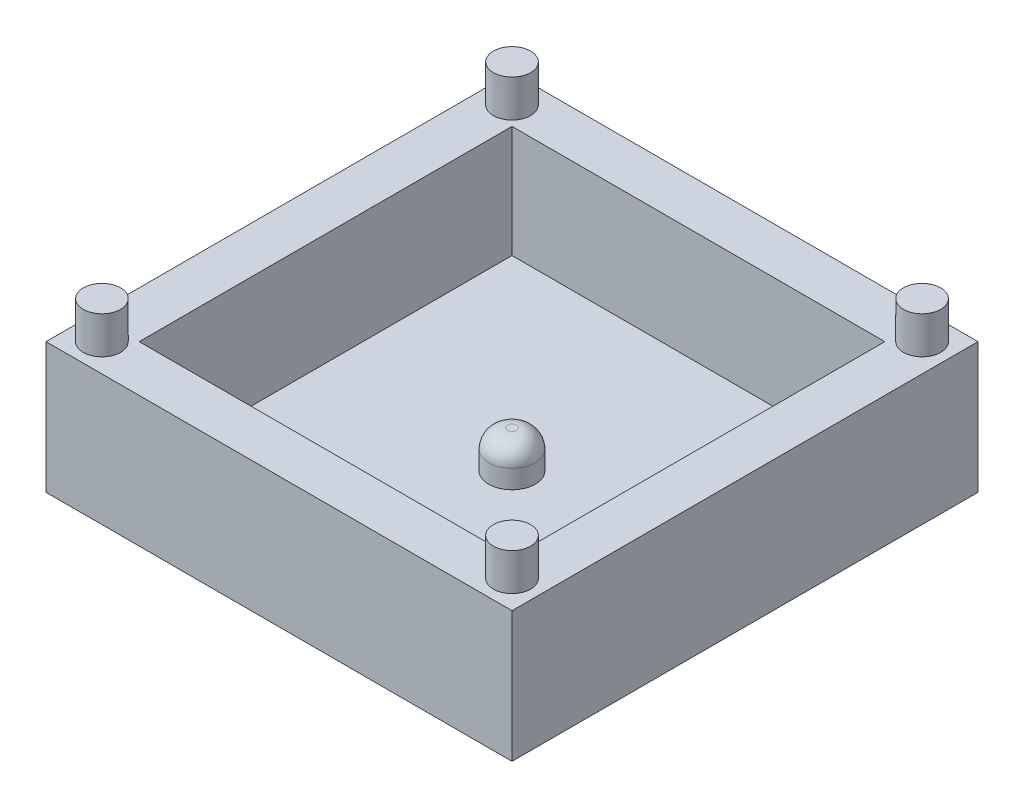
ISO-10303-21;
HEADER;
FILE_DESCRIPTION(('STEP AP214'),'2;1');
FILE_NAME('part.step','',(''),(''),'','','');
FILE_SCHEMA(('AUTOMOTIVE_DESIGN { 1 0 10303 214 1 1 1 1 }'));
ENDSEC;
DATA;
#1=APPLICATION_CONTEXT('core data for automotive mechanical design processes');
#2=APPLICATION_PROTOCOL_DEFINITION('international standard','automotive_design',2000,#1);
#3=PRODUCT_CONTEXT('',#1,'mechanical');
#4=PRODUCT('Part','Part','',(#3));
#5=PRODUCT_RELATED_PRODUCT_CATEGORY('part','',(#4));
#6=PRODUCT_DEFINITION_FORMATION('','',#4);
#7=PRODUCT_DEFINITION_CONTEXT('part definition',#1,'design');
#8=PRODUCT_DEFINITION('design','',#6,#7);
#9=PRODUCT_DEFINITION_SHAPE('','',#8);
#10=(LENGTH_UNIT() NAMED_UNIT(*) SI_UNIT(.MILLI.,.METRE.));
#11=(NAMED_UNIT(*) PLANE_ANGLE_UNIT() SI_UNIT($,.RADIAN.));
#12=(NAMED_UNIT(*) SI_UNIT($,.STERADIAN.) SOLID_ANGLE_UNIT());
#13=UNCERTAINTY_MEASURE_WITH_UNIT(LENGTH_MEASURE(1.E-05),#10,'distance_accuracy_value','');
#14=(GEOMETRIC_REPRESENTATION_CONTEXT(3) GLOBAL_UNCERTAINTY_ASSIGNED_CONTEXT((#13)) GLOBAL_UNIT_ASSIGNED_CONTEXT((#10,
#11,#12)) REPRESENTATION_CONTEXT('',''));
#15=CARTESIAN_POINT('',(0.,0.,0.));
#16=DIRECTION('',(0.,0.,1.));
#17=DIRECTION('',(1.,0.,0.));
#18=AXIS2_PLACEMENT_3D('',#15,#16,#17);
#19=CARTESIAN_POINT('',(12.5,7.,12.5));
#20=DIRECTION('',(-1.,0.,0.));
#21=DIRECTION('',(0.,0.,1.));
#22=AXIS2_PLACEMENT_3D('',#19,#20,#21);
#23=PLANE('',#22);
#24=DIRECTION('',(0.,0.,-1.));
#25=VECTOR('',#24,1.);
#26=CARTESIAN_POINT('',(12.5,0.,12.5));
#27=LINE('',#26,#25);
#28=CARTESIAN_POINT('',(12.5,0.,12.5));
#29=VERTEX_POINT('',#28);
#30=CARTESIAN_POINT('',(12.5,0.,-12.5));
#31=VERTEX_POINT('',#30);
#32=EDGE_CURVE('E146',#29,#31,#27,.T.);
#33=ORIENTED_EDGE('',*,*,#32,.T.);
#34=DIRECTION('',(0.,-1.,0.));
#35=VECTOR('',#34,1.);
#36=CARTESIAN_POINT('',(12.5,7.,-12.5));
#37=LINE('',#36,#35);
#38=CARTESIAN_POINT('',(12.5,7.,-12.5));
#39=VERTEX_POINT('',#38);
#40=EDGE_CURVE('E170',#39,#31,#37,.T.);
#41=ORIENTED_EDGE('',*,*,#40,.F.);
#42=DIRECTION('',(0.,0.,-1.));
#43=VECTOR('',#42,1.);
#44=CARTESIAN_POINT('',(12.5,7.,12.5));
#45=LINE('',#44,#43);
#46=CARTESIAN_POINT('',(12.5,7.,12.5));
#47=VERTEX_POINT('',#46);
#48=EDGE_CURVE('E150',#47,#39,#45,.T.);
#49=ORIENTED_EDGE('',*,*,#48,.F.);
#50=DIRECTION('',(0.,-1.,0.));
#51=VECTOR('',#50,1.);
#52=CARTESIAN_POINT('',(12.5,7.,12.5));
#53=LINE('',#52,#51);
#54=EDGE_CURVE('E156',#47,#29,#53,.T.);
#55=ORIENTED_EDGE('',*,*,#54,.T.);
#56=EDGE_LOOP('',(#33,#41,#49,#55));
#57=FACE_BOUND('',#56,.T.);
#58=ADVANCED_FACE('F33',(#57),#23,.F.);
#59=CARTESIAN_POINT('',(-12.5,7.,-12.5));
#60=DIRECTION('',(0.,0.,1.));
#61=DIRECTION('',(1.,0.,0.));
#62=AXIS2_PLACEMENT_3D('',#59,#60,#61);
#63=PLANE('',#62);
#64=DIRECTION('',(-1.,0.,0.));
#65=VECTOR('',#64,1.);
#66=CARTESIAN_POINT('',(-12.5,0.,-12.5));
#67=LINE('',#66,#65);
#68=CARTESIAN_POINT('',(-12.5,0.,-12.5));
#69=VERTEX_POINT('',#68);
#70=EDGE_CURVE('E159',#31,#69,#67,.T.);
#71=ORIENTED_EDGE('',*,*,#70,.T.);
#72=DIRECTION('',(0.,-1.,0.));
#73=VECTOR('',#72,1.);
#74=CARTESIAN_POINT('',(-12.5,7.,-12.5));
#75=LINE('',#74,#73);
#76=CARTESIAN_POINT('',(-12.5,7.,-12.5));
#77=VERTEX_POINT('',#76);
#78=EDGE_CURVE('E167',#77,#69,#75,.T.);
#79=ORIENTED_EDGE('',*,*,#78,.F.);
#80=DIRECTION('',(-1.,0.,0.));
#81=VECTOR('',#80,1.);
#82=CARTESIAN_POINT('',(-12.5,7.,-12.5));
#83=LINE('',#82,#81);
#84=EDGE_CURVE('E86',#39,#77,#83,.T.);
#85=ORIENTED_EDGE('',*,*,#84,.F.);
#86=ORIENTED_EDGE('',*,*,#40,.T.);
#87=EDGE_LOOP('',(#71,#79,#85,#86));
#88=FACE_BOUND('',#87,.T.);
#89=ADVANCED_FACE('F207',(#88),#63,.F.);
#90=CARTESIAN_POINT('',(-12.5,7.,12.5));
#91=DIRECTION('',(1.,0.,0.));
#92=DIRECTION('',(0.,0.,-1.));
#93=AXIS2_PLACEMENT_3D('',#90,#91,#92);
#94=PLANE('',#93);
#95=DIRECTION('',(0.,0.,1.));
#96=VECTOR('',#95,1.);
#97=CARTESIAN_POINT('',(-12.5,0.,12.5));
#98=LINE('',#97,#96);
#99=CARTESIAN_POINT('',(-12.5,0.,12.5));
#100=VERTEX_POINT('',#99);
#101=EDGE_CURVE('E161',#69,#100,#98,.T.);
#102=ORIENTED_EDGE('',*,*,#101,.T.);
#103=DIRECTION('',(0.,-1.,0.));
#104=VECTOR('',#103,1.);
#105=CARTESIAN_POINT('',(-12.5,7.,12.5));
#106=LINE('',#105,#104);
#107=CARTESIAN_POINT('',(-12.5,7.,12.5));
#108=VERTEX_POINT('',#107);
#109=EDGE_CURVE('E165',#108,#100,#106,.T.);
#110=ORIENTED_EDGE('',*,*,#109,.F.);
#111=DIRECTION('',(0.,0.,1.));
#112=VECTOR('',#111,1.);
#113=CARTESIAN_POINT('',(-12.5,7.,12.5));
#114=LINE('',#113,#112);
#115=EDGE_CURVE('E153',#77,#108,#114,.T.);
#116=ORIENTED_EDGE('',*,*,#115,.F.);
#117=ORIENTED_EDGE('',*,*,#78,.T.);
#118=EDGE_LOOP('',(#102,#110,#116,#117));
#119=FACE_BOUND('',#118,.T.);
#120=ADVANCED_FACE('F212',(#119),#94,.F.);
#121=CARTESIAN_POINT('',(-12.5,7.,12.5));
#122=DIRECTION('',(0.,0.,-1.));
#123=DIRECTION('',(-1.,0.,0.));
#124=AXIS2_PLACEMENT_3D('',#121,#122,#123);
#125=PLANE('',#124);
#126=DIRECTION('',(1.,0.,0.));
#127=VECTOR('',#126,1.);
#128=CARTESIAN_POINT('',(-12.5,0.,12.5));
#129=LINE('',#128,#127);
#130=EDGE_CURVE('E78',#100,#29,#129,.T.);
#131=ORIENTED_EDGE('',*,*,#130,.T.);
#132=ORIENTED_EDGE('',*,*,#54,.F.);
#133=DIRECTION('',(1.,0.,0.));
#134=VECTOR('',#133,1.);
#135=CARTESIAN_POINT('',(-12.5,7.,12.5));
#136=LINE('',#135,#134);
#137=EDGE_CURVE('E57',#108,#47,#136,.T.);
#138=ORIENTED_EDGE('',*,*,#137,.F.);
#139=ORIENTED_EDGE('',*,*,#109,.T.);
#140=EDGE_LOOP('',(#131,#132,#138,#139));
#141=FACE_BOUND('',#140,.T.);
#142=ADVANCED_FACE('F195',(#141),#125,.F.);
#143=CARTESIAN_POINT('',(0.,7.,0.));
#144=DIRECTION('',(0.,-1.,0.));
#145=DIRECTION('',(0.,0.,-1.));
#146=AXIS2_PLACEMENT_3D('',#143,#144,#145);
#147=PLANE('',#146);
#148=CARTESIAN_POINT('',(-11.,7.,11.));
#149=DIRECTION('',(0.,-1.,0.));
#150=DIRECTION('',(0.,0.,-1.));
#151=AXIS2_PLACEMENT_3D('',#148,#149,#150);
#152=CIRCLE('',#151,1.);
#153=CARTESIAN_POINT('',(-11.,7.,10.));
#154=VERTEX_POINT('',#153);
#155=EDGE_CURVE('E11',#154,#154,#152,.F.);
#156=ORIENTED_EDGE('',*,*,#155,.F.);
#157=EDGE_LOOP('',(#156));
#158=FACE_BOUND('',#157,.T.);
#159=CARTESIAN_POINT('',(11.,7.,11.));
#160=DIRECTION('',(0.,-1.,0.));
#161=DIRECTION('',(0.,0.,-1.));
#162=AXIS2_PLACEMENT_3D('',#159,#160,#161);
#163=CIRCLE('',#162,1.);
#164=CARTESIAN_POINT('',(11.,7.,10.));
#165=VERTEX_POINT('',#164);
#166=EDGE_CURVE('E41',#165,#165,#163,.F.);
#167=ORIENTED_EDGE('',*,*,#166,.F.);
#168=EDGE_LOOP('',(#167));
#169=FACE_BOUND('',#168,.T.);
#170=CARTESIAN_POINT('',(11.,7.,-11.));
#171=DIRECTION('',(0.,-1.,0.));
#172=DIRECTION('',(0.,0.,-1.));
#173=AXIS2_PLACEMENT_3D('',#170,#171,#172);
#174=CIRCLE('',#173,1.);
#175=CARTESIAN_POINT('',(11.,7.,-12.));
#176=VERTEX_POINT('',#175);
#177=EDGE_CURVE('E184',#176,#176,#174,.F.);
#178=ORIENTED_EDGE('',*,*,#177,.F.);
#179=EDGE_LOOP('',(#178));
#180=FACE_BOUND('',#179,.T.);
#181=CARTESIAN_POINT('',(-11.,7.,-11.));
#182=DIRECTION('',(0.,-1.,0.));
#183=DIRECTION('',(0.,0.,-1.));
#184=AXIS2_PLACEMENT_3D('',#181,#182,#183);
#185=CIRCLE('',#184,1.);
#186=CARTESIAN_POINT('',(-11.,7.,-12.));
#187=VERTEX_POINT('',#186);
#188=EDGE_CURVE('E181',#187,#187,#185,.F.);
#189=ORIENTED_EDGE('',*,*,#188,.F.);
#190=EDGE_LOOP('',(#189));
#191=FACE_BOUND('',#190,.T.);
#192=DIRECTION('',(-1.,0.,0.));
#193=VECTOR('',#192,1.);
#194=CARTESIAN_POINT('',(-10.,7.,-10.));
#195=LINE('',#194,#193);
#196=CARTESIAN_POINT('',(10.,7.,-10.));
#197=VERTEX_POINT('',#196);
#198=CARTESIAN_POINT('',(-10.,7.,-10.));
#199=VERTEX_POINT('',#198);
#200=EDGE_CURVE('E140',#197,#199,#195,.T.);
#201=ORIENTED_EDGE('',*,*,#200,.F.);
#202=DIRECTION('',(0.,0.,-1.));
#203=VECTOR('',#202,1.);
#204=CARTESIAN_POINT('',(10.,7.,10.));
#205=LINE('',#204,#203);
#206=CARTESIAN_POINT('',(10.,7.,10.));
#207=VERTEX_POINT('',#206);
#208=EDGE_CURVE('E48',#207,#197,#205,.T.);
#209=ORIENTED_EDGE('',*,*,#208,.F.);
#210=DIRECTION('',(1.,0.,0.));
#211=VECTOR('',#210,1.);
#212=CARTESIAN_POINT('',(-10.,7.,10.));
#213=LINE('',#212,#211);
#214=CARTESIAN_POINT('',(-10.,7.,10.));
#215=VERTEX_POINT('',#214);
#216=EDGE_CURVE('E128',#215,#207,#213,.T.);
#217=ORIENTED_EDGE('',*,*,#216,.F.);
#218=DIRECTION('',(0.,0.,1.));
#219=VECTOR('',#218,1.);
#220=CARTESIAN_POINT('',(-10.,7.,10.));
#221=LINE('',#220,#219);
#222=EDGE_CURVE('E131',#199,#215,#221,.T.);
#223=ORIENTED_EDGE('',*,*,#222,.F.);
#224=EDGE_LOOP('',(#201,#209,#217,#223));
#225=FACE_BOUND('',#224,.T.);
#226=ORIENTED_EDGE('',*,*,#48,.T.);
#227=ORIENTED_EDGE('',*,*,#84,.T.);
#228=ORIENTED_EDGE('',*,*,#115,.T.);
#229=ORIENTED_EDGE('',*,*,#137,.T.);
#230=EDGE_LOOP('',(#226,#227,#228,#229));
#231=FACE_BOUND('',#230,.T.);
#232=ADVANCED_FACE('F191',(#158,#169,#180,#191,#225,#231),#147,.F.);
#233=CARTESIAN_POINT('',(0.,0.,0.));
#234=DIRECTION('',(0.,-1.,0.));
#235=DIRECTION('',(0.,0.,-1.));
#236=AXIS2_PLACEMENT_3D('',#233,#234,#235);
#237=PLANE('',#236);
#238=ORIENTED_EDGE('',*,*,#32,.F.);
#239=ORIENTED_EDGE('',*,*,#130,.F.);
#240=ORIENTED_EDGE('',*,*,#101,.F.);
#241=ORIENTED_EDGE('',*,*,#70,.F.);
#242=EDGE_LOOP('',(#238,#239,#240,#241));
#243=FACE_BOUND('',#242,.T.);
#244=ADVANCED_FACE('F194',(#243),#237,.T.);
#245=CARTESIAN_POINT('',(10.,1.,10.));
#246=DIRECTION('',(1.,0.,0.));
#247=DIRECTION('',(0.,0.,-1.));
#248=AXIS2_PLACEMENT_3D('',#245,#246,#247);
#249=PLANE('',#248);
#250=ORIENTED_EDGE('',*,*,#208,.T.);
#251=DIRECTION('',(0.,1.,0.));
#252=VECTOR('',#251,1.);
#253=CARTESIAN_POINT('',(10.,1.,-10.));
#254=LINE('',#253,#252);
#255=CARTESIAN_POINT('',(10.,1.,-10.));
#256=VERTEX_POINT('',#255);
#257=EDGE_CURVE('E106',#256,#197,#254,.T.);
#258=ORIENTED_EDGE('',*,*,#257,.F.);
#259=DIRECTION('',(0.,0.,-1.));
#260=VECTOR('',#259,1.);
#261=CARTESIAN_POINT('',(10.,1.,10.));
#262=LINE('',#261,#260);
#263=CARTESIAN_POINT('',(10.,1.,10.));
#264=VERTEX_POINT('',#263);
#265=EDGE_CURVE('E110',#264,#256,#262,.T.);
#266=ORIENTED_EDGE('',*,*,#265,.F.);
#267=DIRECTION('',(0.,1.,0.));
#268=VECTOR('',#267,1.);
#269=CARTESIAN_POINT('',(10.,1.,10.));
#270=LINE('',#269,#268);
#271=EDGE_CURVE('E144',#264,#207,#270,.T.);
#272=ORIENTED_EDGE('',*,*,#271,.T.);
#273=EDGE_LOOP('',(#250,#258,#266,#272));
#274=FACE_BOUND('',#273,.T.);
#275=ADVANCED_FACE('F108',(#274),#249,.F.);
#276=CARTESIAN_POINT('',(-10.,1.,10.));
#277=DIRECTION('',(0.,0.,1.));
#278=DIRECTION('',(1.,0.,0.));
#279=AXIS2_PLACEMENT_3D('',#276,#277,#278);
#280=PLANE('',#279);
#281=ORIENTED_EDGE('',*,*,#216,.T.);
#282=ORIENTED_EDGE('',*,*,#271,.F.);
#283=DIRECTION('',(1.,0.,0.));
#284=VECTOR('',#283,1.);
#285=CARTESIAN_POINT('',(-10.,1.,10.));
#286=LINE('',#285,#284);
#287=CARTESIAN_POINT('',(-10.,1.,10.));
#288=VERTEX_POINT('',#287);
#289=EDGE_CURVE('E116',#288,#264,#286,.T.);
#290=ORIENTED_EDGE('',*,*,#289,.F.);
#291=DIRECTION('',(0.,1.,0.));
#292=VECTOR('',#291,1.);
#293=CARTESIAN_POINT('',(-10.,1.,10.));
#294=LINE('',#293,#292);
#295=EDGE_CURVE('E147',#288,#215,#294,.T.);
#296=ORIENTED_EDGE('',*,*,#295,.T.);
#297=EDGE_LOOP('',(#281,#282,#290,#296));
#298=FACE_BOUND('',#297,.T.);
#299=ADVANCED_FACE('F219',(#298),#280,.F.);
#300=CARTESIAN_POINT('',(-10.,1.,10.));
#301=DIRECTION('',(-1.,0.,0.));
#302=DIRECTION('',(0.,0.,1.));
#303=AXIS2_PLACEMENT_3D('',#300,#301,#302);
#304=PLANE('',#303);
#305=ORIENTED_EDGE('',*,*,#222,.T.);
#306=ORIENTED_EDGE('',*,*,#295,.F.);
#307=DIRECTION('',(0.,0.,1.));
#308=VECTOR('',#307,1.);
#309=CARTESIAN_POINT('',(-10.,1.,10.));
#310=LINE('',#309,#308);
#311=CARTESIAN_POINT('',(-10.,1.,-10.));
#312=VERTEX_POINT('',#311);
#313=EDGE_CURVE('E124',#312,#288,#310,.T.);
#314=ORIENTED_EDGE('',*,*,#313,.F.);
#315=DIRECTION('',(0.,1.,0.));
#316=VECTOR('',#315,1.);
#317=CARTESIAN_POINT('',(-10.,1.,-10.));
#318=LINE('',#317,#316);
#319=EDGE_CURVE('E115',#312,#199,#318,.T.);
#320=ORIENTED_EDGE('',*,*,#319,.T.);
#321=EDGE_LOOP('',(#305,#306,#314,#320));
#322=FACE_BOUND('',#321,.T.);
#323=ADVANCED_FACE('F342',(#322),#304,.F.);
#324=CARTESIAN_POINT('',(-10.,1.,-10.));
#325=DIRECTION('',(0.,0.,-1.));
#326=DIRECTION('',(-1.,0.,0.));
#327=AXIS2_PLACEMENT_3D('',#324,#325,#326);
#328=PLANE('',#327);
#329=ORIENTED_EDGE('',*,*,#200,.T.);
#330=ORIENTED_EDGE('',*,*,#319,.F.);
#331=DIRECTION('',(-1.,0.,0.));
#332=VECTOR('',#331,1.);
#333=CARTESIAN_POINT('',(-10.,1.,-10.));
#334=LINE('',#333,#332);
#335=EDGE_CURVE('E119',#256,#312,#334,.T.);
#336=ORIENTED_EDGE('',*,*,#335,.F.);
#337=ORIENTED_EDGE('',*,*,#257,.T.);
#338=EDGE_LOOP('',(#329,#330,#336,#337));
#339=FACE_BOUND('',#338,.T.);
#340=ADVANCED_FACE('F120',(#339),#328,.F.);
#341=CARTESIAN_POINT('',(0.,1.,0.));
#342=DIRECTION('',(0.,-1.,0.));
#343=DIRECTION('',(0.,0.,-1.));
#344=AXIS2_PLACEMENT_3D('',#341,#342,#343);
#345=PLANE('',#344);
#346=CARTESIAN_POINT('',(0.,1.,0.));
#347=DIRECTION('',(0.,-1.,0.));
#348=DIRECTION('',(0.,0.,-1.));
#349=AXIS2_PLACEMENT_3D('',#346,#347,#348);
#350=CIRCLE('',#349,1.25);
#351=CARTESIAN_POINT('',(0.,1.,-1.25));
#352=VERTEX_POINT('',#351);
#353=EDGE_CURVE('E172',#352,#352,#350,.F.);
#354=ORIENTED_EDGE('',*,*,#353,.F.);
#355=EDGE_LOOP('',(#354));
#356=FACE_BOUND('',#355,.T.);
#357=ORIENTED_EDGE('',*,*,#265,.T.);
#358=ORIENTED_EDGE('',*,*,#335,.T.);
#359=ORIENTED_EDGE('',*,*,#313,.T.);
#360=ORIENTED_EDGE('',*,*,#289,.T.);
#361=EDGE_LOOP('',(#357,#358,#359,#360));
#362=FACE_BOUND('',#361,.T.);
#363=ADVANCED_FACE('F126',(#356,#362),#345,.F.);
#364=CARTESIAN_POINT('',(0.,3.,0.));
#365=DIRECTION('',(0.,-1.,0.));
#366=DIRECTION('',(0.,0.,-1.));
#367=AXIS2_PLACEMENT_3D('',#364,#365,#366);
#368=CYLINDRICAL_SURFACE('',#367,1.25);
#369=CARTESIAN_POINT('',(0.,2.,0.));
#370=DIRECTION('',(0.,1.,0.));
#371=DIRECTION('',(0.,0.,1.));
#372=AXIS2_PLACEMENT_3D('',#369,#370,#371);
#373=CIRCLE('',#372,1.25);
#374=CARTESIAN_POINT('',(0.,2.,1.25));
#375=VERTEX_POINT('',#374);
#376=EDGE_CURVE('E178',#375,#375,#373,.F.);
#377=ORIENTED_EDGE('',*,*,#376,.T.);
#378=EDGE_LOOP('',(#377));
#379=FACE_BOUND('',#378,.T.);
#380=ORIENTED_EDGE('',*,*,#353,.T.);
#381=EDGE_LOOP('',(#380));
#382=FACE_BOUND('',#381,.T.);
#383=ADVANCED_FACE('F332',(#379,#382),#368,.T.);
#384=CARTESIAN_POINT('',(0.,3.,0.));
#385=DIRECTION('',(0.,1.,0.));
#386=DIRECTION('',(0.,0.,1.));
#387=AXIS2_PLACEMENT_3D('',#384,#385,#386);
#388=PLANE('',#387);
#389=CARTESIAN_POINT('',(0.,3.,0.));
#390=DIRECTION('',(0.,1.,0.));
#391=DIRECTION('',(0.,0.,1.));
#392=AXIS2_PLACEMENT_3D('',#389,#390,#391);
#393=CIRCLE('',#392,0.25);
#394=CARTESIAN_POINT('',(0.,3.,0.25));
#395=VERTEX_POINT('',#394);
#396=EDGE_CURVE('E175',#395,#395,#393,.T.);
#397=ORIENTED_EDGE('',*,*,#396,.T.);
#398=EDGE_LOOP('',(#397));
#399=FACE_BOUND('',#398,.T.);
#400=ADVANCED_FACE('F329',(#399),#388,.T.);
#401=CARTESIAN_POINT('',(0.,2.,0.));
#402=DIRECTION('',(0.,1.,0.));
#403=DIRECTION('',(0.,0.,1.));
#404=AXIS2_PLACEMENT_3D('',#401,#402,#403);
#405=DEGENERATE_TOROIDAL_SURFACE('',#404,0.25,1.,.T.);
#406=ORIENTED_EDGE('',*,*,#376,.F.);
#407=EDGE_LOOP('',(#406));
#408=FACE_BOUND('',#407,.T.);
#409=ORIENTED_EDGE('',*,*,#396,.F.);
#410=EDGE_LOOP('',(#409));
#411=FACE_BOUND('',#410,.T.);
#412=ADVANCED_FACE('F35',(#408,#411),#405,.T.);
#413=CARTESIAN_POINT('',(-11.,9.,-11.));
#414=DIRECTION('',(0.,-1.,0.));
#415=DIRECTION('',(0.,0.,-1.));
#416=AXIS2_PLACEMENT_3D('',#413,#414,#415);
#417=CYLINDRICAL_SURFACE('',#416,1.);
#418=CARTESIAN_POINT('',(-11.,9.,-11.));
#419=DIRECTION('',(0.,1.,0.));
#420=DIRECTION('',(0.,0.,1.));
#421=AXIS2_PLACEMENT_3D('',#418,#419,#420);
#422=CIRCLE('',#421,1.);
#423=CARTESIAN_POINT('',(-11.,9.,-10.));
#424=VERTEX_POINT('',#423);
#425=EDGE_CURVE('E134',#424,#424,#422,.T.);
#426=ORIENTED_EDGE('',*,*,#425,.F.);
#427=EDGE_LOOP('',(#426));
#428=FACE_BOUND('',#427,.T.);
#429=ORIENTED_EDGE('',*,*,#188,.T.);
#430=EDGE_LOOP('',(#429));
#431=FACE_BOUND('',#430,.T.);
#432=ADVANCED_FACE('F249',(#428,#431),#417,.T.);
#433=CARTESIAN_POINT('',(-11.,9.,-11.));
#434=DIRECTION('',(0.,1.,0.));
#435=DIRECTION('',(0.,0.,1.));
#436=AXIS2_PLACEMENT_3D('',#433,#434,#435);
#437=PLANE('',#436);
#438=ORIENTED_EDGE('',*,*,#425,.T.);
#439=EDGE_LOOP('',(#438));
#440=FACE_BOUND('',#439,.T.);
#441=ADVANCED_FACE('F254',(#440),#437,.T.);
#442=CARTESIAN_POINT('',(11.,9.,-11.));
#443=DIRECTION('',(0.,-1.,0.));
#444=DIRECTION('',(0.,0.,-1.));
#445=AXIS2_PLACEMENT_3D('',#442,#443,#444);
#446=CYLINDRICAL_SURFACE('',#445,1.);
#447=CARTESIAN_POINT('',(11.,9.,-11.));
#448=DIRECTION('',(0.,1.,0.));
#449=DIRECTION('',(0.,0.,1.));
#450=AXIS2_PLACEMENT_3D('',#447,#448,#449);
#451=CIRCLE('',#450,1.);
#452=CARTESIAN_POINT('',(11.,9.,-9.99999999999999));
#453=VERTEX_POINT('',#452);
#454=EDGE_CURVE('E407',#453,#453,#451,.T.);
#455=ORIENTED_EDGE('',*,*,#454,.F.);
#456=EDGE_LOOP('',(#455));
#457=FACE_BOUND('',#456,.T.);
#458=ORIENTED_EDGE('',*,*,#177,.T.);
#459=EDGE_LOOP('',(#458));
#460=FACE_BOUND('',#459,.T.);
#461=ADVANCED_FACE('F264',(#457,#460),#446,.T.);
#462=CARTESIAN_POINT('',(11.,9.,-11.));
#463=DIRECTION('',(0.,1.,0.));
#464=DIRECTION('',(0.,0.,1.));
#465=AXIS2_PLACEMENT_3D('',#462,#463,#464);
#466=PLANE('',#465);
#467=ORIENTED_EDGE('',*,*,#454,.T.);
#468=EDGE_LOOP('',(#467));
#469=FACE_BOUND('',#468,.T.);
#470=ADVANCED_FACE('F274',(#469),#466,.T.);
#471=CARTESIAN_POINT('',(11.,9.,11.));
#472=DIRECTION('',(0.,-1.,0.));
#473=DIRECTION('',(0.,0.,-1.));
#474=AXIS2_PLACEMENT_3D('',#471,#472,#473);
#475=CYLINDRICAL_SURFACE('',#474,1.);
#476=CARTESIAN_POINT('',(11.,9.,11.));
#477=DIRECTION('',(0.,1.,0.));
#478=DIRECTION('',(0.,0.,1.));
#479=AXIS2_PLACEMENT_3D('',#476,#477,#478);
#480=CIRCLE('',#479,1.);
#481=CARTESIAN_POINT('',(11.,9.,12.));
#482=VERTEX_POINT('',#481);
#483=EDGE_CURVE('E404',#482,#482,#480,.T.);
#484=ORIENTED_EDGE('',*,*,#483,.F.);
#485=EDGE_LOOP('',(#484));
#486=FACE_BOUND('',#485,.T.);
#487=ORIENTED_EDGE('',*,*,#166,.T.);
#488=EDGE_LOOP('',(#487));
#489=FACE_BOUND('',#488,.T.);
#490=ADVANCED_FACE('F189',(#486,#489),#475,.T.);
#491=CARTESIAN_POINT('',(11.,9.,11.));
#492=DIRECTION('',(0.,1.,0.));
#493=DIRECTION('',(0.,0.,1.));
#494=AXIS2_PLACEMENT_3D('',#491,#492,#493);
#495=PLANE('',#494);
#496=ORIENTED_EDGE('',*,*,#483,.T.);
#497=EDGE_LOOP('',(#496));
#498=FACE_BOUND('',#497,.T.);
#499=ADVANCED_FACE('F293',(#498),#495,.T.);
#500=CARTESIAN_POINT('',(-11.,9.,11.));
#501=DIRECTION('',(0.,-1.,0.));
#502=DIRECTION('',(0.,0.,-1.));
#503=AXIS2_PLACEMENT_3D('',#500,#501,#502);
#504=CYLINDRICAL_SURFACE('',#503,1.);
#505=CARTESIAN_POINT('',(-11.,9.,11.));
#506=DIRECTION('',(0.,1.,0.));
#507=DIRECTION('',(0.,0.,1.));
#508=AXIS2_PLACEMENT_3D('',#505,#506,#507);
#509=CIRCLE('',#508,1.);
#510=CARTESIAN_POINT('',(-11.,9.,12.));
#511=VERTEX_POINT('',#510);
#512=EDGE_CURVE('E403',#511,#511,#509,.T.);
#513=ORIENTED_EDGE('',*,*,#512,.F.);
#514=EDGE_LOOP('',(#513));
#515=FACE_BOUND('',#514,.T.);
#516=ORIENTED_EDGE('',*,*,#155,.T.);
#517=EDGE_LOOP('',(#516));
#518=FACE_BOUND('',#517,.T.);
#519=ADVANCED_FACE('F303',(#515,#518),#504,.T.);
#520=CARTESIAN_POINT('',(-11.,9.,11.));
#521=DIRECTION('',(0.,1.,0.));
#522=DIRECTION('',(0.,0.,1.));
#523=AXIS2_PLACEMENT_3D('',#520,#521,#522);
#524=PLANE('',#523);
#525=ORIENTED_EDGE('',*,*,#512,.T.);
#526=EDGE_LOOP('',(#525));
#527=FACE_BOUND('',#526,.T.);
#528=ADVANCED_FACE('F313',(#527),#524,.T.);
#529=CLOSED_SHELL('',(#58,#89,#120,#142,#232,#244,#275,#299,#323,#340,#363,#383,#400,#412,#432,
#441,#461,#470,#490,#499,#519,#528));
#530=MANIFOLD_SOLID_BREP('B2',#529);
#531=ADVANCED_BREP_SHAPE_REPRESENTATION('',(#18,#530),#14);
#532=SHAPE_DEFINITION_REPRESENTATION(#9,#531);
ENDSEC;
END-ISO-10303-21;
